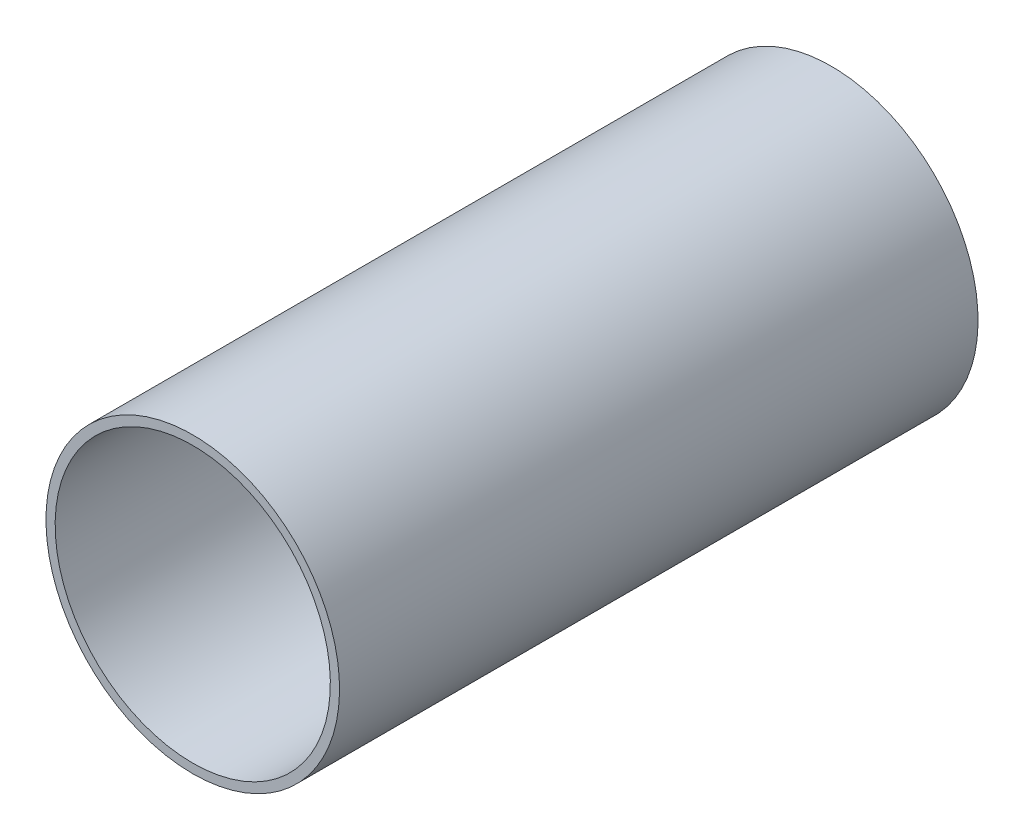
ISO-10303-21;
HEADER;
FILE_DESCRIPTION(('STEP AP214'),'2;1');
FILE_NAME('part.step','',(''),(''),'','','');
FILE_SCHEMA(('AUTOMOTIVE_DESIGN { 1 0 10303 214 1 1 1 1 }'));
ENDSEC;
DATA;
#1=APPLICATION_CONTEXT('core data for automotive mechanical design processes');
#2=APPLICATION_PROTOCOL_DEFINITION('international standard','automotive_design',2000,#1);
#3=PRODUCT_CONTEXT('',#1,'mechanical');
#4=PRODUCT('Part','Part','',(#3));
#5=PRODUCT_RELATED_PRODUCT_CATEGORY('part','',(#4));
#6=PRODUCT_DEFINITION_FORMATION('','',#4);
#7=PRODUCT_DEFINITION_CONTEXT('part definition',#1,'design');
#8=PRODUCT_DEFINITION('design','',#6,#7);
#9=PRODUCT_DEFINITION_SHAPE('','',#8);
#10=(LENGTH_UNIT() NAMED_UNIT(*) SI_UNIT(.MILLI.,.METRE.));
#11=(NAMED_UNIT(*) PLANE_ANGLE_UNIT() SI_UNIT($,.RADIAN.));
#12=(NAMED_UNIT(*) SI_UNIT($,.STERADIAN.) SOLID_ANGLE_UNIT());
#13=UNCERTAINTY_MEASURE_WITH_UNIT(LENGTH_MEASURE(1.E-05),#10,'distance_accuracy_value','');
#14=(GEOMETRIC_REPRESENTATION_CONTEXT(3) GLOBAL_UNCERTAINTY_ASSIGNED_CONTEXT((#13)) GLOBAL_UNIT_ASSIGNED_CONTEXT((#10,
#11,#12)) REPRESENTATION_CONTEXT('',''));
#15=CARTESIAN_POINT('',(0.,0.,0.));
#16=DIRECTION('',(0.,0.,1.));
#17=DIRECTION('',(1.,0.,0.));
#18=AXIS2_PLACEMENT_3D('',#15,#16,#17);
#19=CARTESIAN_POINT('',(157.48,-103.632,-0.045));
#20=DIRECTION('',(0.,0.,-1.));
#21=DIRECTION('',(0.,-1.,0.));
#22=AXIS2_PLACEMENT_3D('',#19,#20,#21);
#23=CYLINDRICAL_SURFACE('',#22,0.375);
#24=CARTESIAN_POINT('',(157.48,-103.632,-0.035));
#25=DIRECTION('',(0.,0.,-1.));
#26=DIRECTION('',(0.,-1.,0.));
#27=AXIS2_PLACEMENT_3D('',#24,#25,#26);
#28=CIRCLE('',#27,0.375);
#29=CARTESIAN_POINT('',(157.48,-104.007,-0.035));
#30=VERTEX_POINT('',#29);
#31=EDGE_CURVE('E64',#30,#30,#28,.T.);
#32=ORIENTED_EDGE('',*,*,#31,.T.);
#33=DIRECTION('',(0.,0.,1.));
#34=VECTOR('',#33,1.);
#35=CARTESIAN_POINT('',(157.48,-104.007,-0.045));
#36=LINE('',#35,#34);
#37=CARTESIAN_POINT('',(157.48,-104.007,1.705));
#38=VERTEX_POINT('',#37);
#39=EDGE_CURVE('E11',#30,#38,#36,.T.);
#40=ORIENTED_EDGE('',*,*,#39,.T.);
#41=CARTESIAN_POINT('',(157.48,-103.632,1.705));
#42=DIRECTION('',(0.,0.,-1.));
#43=DIRECTION('',(0.,-1.,0.));
#44=AXIS2_PLACEMENT_3D('',#41,#42,#43);
#45=CIRCLE('',#44,0.375);
#46=EDGE_CURVE('E25',#38,#38,#45,.T.);
#47=ORIENTED_EDGE('',*,*,#46,.F.);
#48=ORIENTED_EDGE('',*,*,#39,.F.);
#49=EDGE_LOOP('',(#32,#40,#47,#48));
#50=FACE_BOUND('',#49,.T.);
#51=ADVANCED_FACE('F17',(#50),#23,.F.);
#52=CARTESIAN_POINT('',(157.48,-104.032,1.705));
#53=DIRECTION('',(0.,0.,1.));
#54=DIRECTION('',(1.,0.,0.));
#55=AXIS2_PLACEMENT_3D('',#52,#53,#54);
#56=PLANE('',#55);
#57=ORIENTED_EDGE('',*,*,#46,.T.);
#58=EDGE_LOOP('',(#57));
#59=FACE_BOUND('',#58,.T.);
#60=CARTESIAN_POINT('',(157.48,-103.632,1.705));
#61=DIRECTION('',(0.,0.,1.));
#62=DIRECTION('',(0.,-1.,0.));
#63=AXIS2_PLACEMENT_3D('',#60,#61,#62);
#64=CIRCLE('',#63,0.4);
#65=CARTESIAN_POINT('',(157.48,-104.032,1.705));
#66=VERTEX_POINT('',#65);
#67=EDGE_CURVE('E56',#66,#66,#64,.T.);
#68=ORIENTED_EDGE('',*,*,#67,.T.);
#69=EDGE_LOOP('',(#68));
#70=FACE_BOUND('',#69,.T.);
#71=ADVANCED_FACE('F76',(#59,#70),#56,.T.);
#72=CARTESIAN_POINT('',(157.48,-104.032,-0.035));
#73=DIRECTION('',(0.,0.,1.));
#74=DIRECTION('',(1.,0.,0.));
#75=AXIS2_PLACEMENT_3D('',#72,#73,#74);
#76=PLANE('',#75);
#77=ORIENTED_EDGE('',*,*,#31,.F.);
#78=EDGE_LOOP('',(#77));
#79=FACE_BOUND('',#78,.T.);
#80=CARTESIAN_POINT('',(157.48,-103.632,-0.035));
#81=DIRECTION('',(0.,0.,1.));
#82=DIRECTION('',(0.,-1.,0.));
#83=AXIS2_PLACEMENT_3D('',#80,#81,#82);
#84=CIRCLE('',#83,0.4);
#85=CARTESIAN_POINT('',(157.48,-104.032,-0.035));
#86=VERTEX_POINT('',#85);
#87=EDGE_CURVE('E55',#86,#86,#84,.T.);
#88=ORIENTED_EDGE('',*,*,#87,.F.);
#89=EDGE_LOOP('',(#88));
#90=FACE_BOUND('',#89,.T.);
#91=ADVANCED_FACE('F84',(#79,#90),#76,.F.);
#92=CARTESIAN_POINT('',(157.48,-103.632,-0.035));
#93=DIRECTION('',(0.,0.,-1.));
#94=DIRECTION('',(0.,-1.,0.));
#95=AXIS2_PLACEMENT_3D('',#92,#93,#94);
#96=CYLINDRICAL_SURFACE('',#95,0.4);
#97=ORIENTED_EDGE('',*,*,#87,.T.);
#98=DIRECTION('',(0.,0.,1.));
#99=VECTOR('',#98,1.);
#100=CARTESIAN_POINT('',(157.48,-104.032,-0.035));
#101=LINE('',#100,#99);
#102=EDGE_CURVE('E52',#86,#66,#101,.T.);
#103=ORIENTED_EDGE('',*,*,#102,.T.);
#104=ORIENTED_EDGE('',*,*,#67,.F.);
#105=ORIENTED_EDGE('',*,*,#102,.F.);
#106=EDGE_LOOP('',(#97,#103,#104,#105));
#107=FACE_BOUND('',#106,.T.);
#108=ADVANCED_FACE('F53',(#107),#96,.T.);
#109=CLOSED_SHELL('',(#51,#71,#91,#108));
#110=MANIFOLD_SOLID_BREP('B1',#109);
#111=ADVANCED_BREP_SHAPE_REPRESENTATION('',(#18,#110),#14);
#112=SHAPE_DEFINITION_REPRESENTATION(#9,#111);
ENDSEC;
END-ISO-10303-21;
